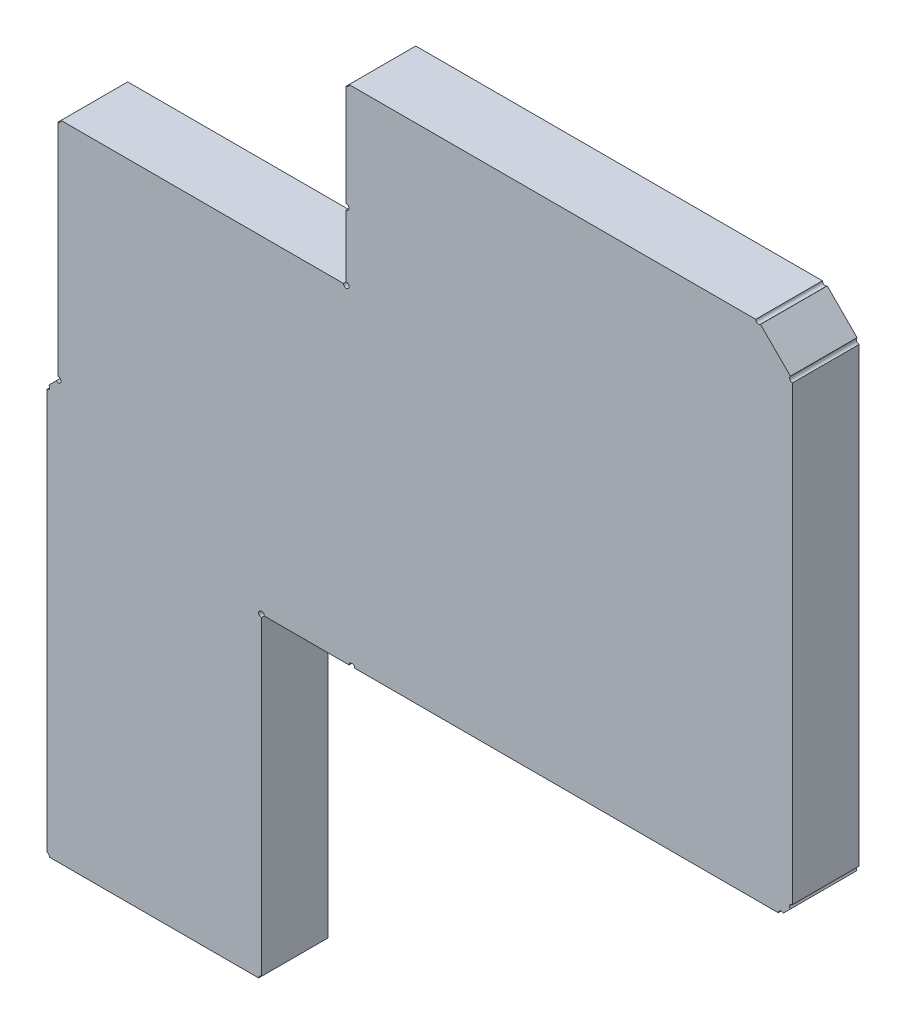
ISO-10303-21;
HEADER;
FILE_DESCRIPTION(('STEP AP214'),'2;1');
FILE_NAME('part.step','',(''),(''),'','','');
FILE_SCHEMA(('AUTOMOTIVE_DESIGN { 1 0 10303 214 1 1 1 1 }'));
ENDSEC;
DATA;
#1=APPLICATION_CONTEXT('core data for automotive mechanical design processes');
#2=APPLICATION_PROTOCOL_DEFINITION('international standard','automotive_design',2000,#1);
#3=PRODUCT_CONTEXT('',#1,'mechanical');
#4=PRODUCT('Part','Part','',(#3));
#5=PRODUCT_RELATED_PRODUCT_CATEGORY('part','',(#4));
#6=PRODUCT_DEFINITION_FORMATION('','',#4);
#7=PRODUCT_DEFINITION_CONTEXT('part definition',#1,'design');
#8=PRODUCT_DEFINITION('design','',#6,#7);
#9=PRODUCT_DEFINITION_SHAPE('','',#8);
#10=(LENGTH_UNIT() NAMED_UNIT(*) SI_UNIT(.MILLI.,.METRE.));
#11=(NAMED_UNIT(*) PLANE_ANGLE_UNIT() SI_UNIT($,.RADIAN.));
#12=(NAMED_UNIT(*) SI_UNIT($,.STERADIAN.) SOLID_ANGLE_UNIT());
#13=UNCERTAINTY_MEASURE_WITH_UNIT(LENGTH_MEASURE(1.E-05),#10,'distance_accuracy_value','');
#14=(GEOMETRIC_REPRESENTATION_CONTEXT(3) GLOBAL_UNCERTAINTY_ASSIGNED_CONTEXT((#13)) GLOBAL_UNIT_ASSIGNED_CONTEXT((#10,
#11,#12)) REPRESENTATION_CONTEXT('',''));
#15=CARTESIAN_POINT('',(0.,0.,0.));
#16=DIRECTION('',(0.,0.,1.));
#17=DIRECTION('',(1.,0.,0.));
#18=AXIS2_PLACEMENT_3D('',#15,#16,#17);
#19=CARTESIAN_POINT('',(91.186,90.424,1.5));
#20=DIRECTION('',(0.,0.,-1.));
#21=DIRECTION('',(-1.,0.,0.));
#22=AXIS2_PLACEMENT_3D('',#19,#20,#21);
#23=CYLINDRICAL_SURFACE('',#22,0.0634999999999941);
#24=CARTESIAN_POINT('',(91.186,90.424,0.));
#25=DIRECTION('',(0.,0.,1.));
#26=DIRECTION('',(1.,0.,0.));
#27=AXIS2_PLACEMENT_3D('',#24,#25,#26);
#28=CIRCLE('',#27,0.0634999999999941);
#29=CARTESIAN_POINT('',(91.186,90.3605,0.));
#30=VERTEX_POINT('',#29);
#31=CARTESIAN_POINT('',(91.2495,90.424,0.));
#32=VERTEX_POINT('',#31);
#33=EDGE_CURVE('E257',#30,#32,#28,.T.);
#34=ORIENTED_EDGE('',*,*,#33,.F.);
#35=DIRECTION('',(0.,0.,-1.));
#36=VECTOR('',#35,1.);
#37=CARTESIAN_POINT('',(91.186,90.3605,1.5));
#38=LINE('',#37,#36);
#39=CARTESIAN_POINT('',(91.186,90.3605,1.5));
#40=VERTEX_POINT('',#39);
#41=EDGE_CURVE('E11',#40,#30,#38,.T.);
#42=ORIENTED_EDGE('',*,*,#41,.F.);
#43=CARTESIAN_POINT('',(91.186,90.424,1.5));
#44=DIRECTION('',(0.,0.,1.));
#45=DIRECTION('',(1.,0.,0.));
#46=AXIS2_PLACEMENT_3D('',#43,#44,#45);
#47=CIRCLE('',#46,0.0634999999999941);
#48=CARTESIAN_POINT('',(91.2495,90.424,1.5));
#49=VERTEX_POINT('',#48);
#50=EDGE_CURVE('E365',#40,#49,#47,.T.);
#51=ORIENTED_EDGE('',*,*,#50,.T.);
#52=DIRECTION('',(0.,0.,-1.));
#53=VECTOR('',#52,1.);
#54=CARTESIAN_POINT('',(91.2495,90.424,1.5));
#55=LINE('',#54,#53);
#56=EDGE_CURVE('E56',#49,#32,#55,.T.);
#57=ORIENTED_EDGE('',*,*,#56,.T.);
#58=EDGE_LOOP('',(#34,#42,#51,#57));
#59=FACE_BOUND('',#58,.T.);
#60=ADVANCED_FACE('F39',(#59),#23,.F.);
#61=CARTESIAN_POINT('',(91.186,0.,1.5));
#62=DIRECTION('',(-1.,0.,0.));
#63=DIRECTION('',(0.,0.,1.));
#64=AXIS2_PLACEMENT_3D('',#61,#62,#63);
#65=PLANE('',#64);
#66=DIRECTION('',(0.,1.,0.));
#67=VECTOR('',#66,1.);
#68=CARTESIAN_POINT('',(91.186,0.,0.));
#69=LINE('',#68,#67);
#70=CARTESIAN_POINT('',(91.186,85.4075,0.));
#71=VERTEX_POINT('',#70);
#72=EDGE_CURVE('E260',#71,#30,#69,.T.);
#73=ORIENTED_EDGE('',*,*,#72,.F.);
#74=DIRECTION('',(0.,0.,-1.));
#75=VECTOR('',#74,1.);
#76=CARTESIAN_POINT('',(91.186,85.4075,1.5));
#77=LINE('',#76,#75);
#78=CARTESIAN_POINT('',(91.186,85.4075,1.5));
#79=VERTEX_POINT('',#78);
#80=EDGE_CURVE('E48',#79,#71,#77,.T.);
#81=ORIENTED_EDGE('',*,*,#80,.F.);
#82=DIRECTION('',(0.,1.,0.));
#83=VECTOR('',#82,1.);
#84=CARTESIAN_POINT('',(91.186,0.,1.5));
#85=LINE('',#84,#83);
#86=EDGE_CURVE('E460',#79,#40,#85,.T.);
#87=ORIENTED_EDGE('',*,*,#86,.T.);
#88=ORIENTED_EDGE('',*,*,#41,.T.);
#89=EDGE_LOOP('',(#73,#81,#87,#88));
#90=FACE_BOUND('',#89,.T.);
#91=ADVANCED_FACE('F448',(#90),#65,.T.);
#92=CARTESIAN_POINT('',(91.186,85.344,1.5));
#93=DIRECTION('',(0.,0.,-1.));
#94=DIRECTION('',(-1.,0.,0.));
#95=AXIS2_PLACEMENT_3D('',#92,#93,#94);
#96=CYLINDRICAL_SURFACE('',#95,0.0634999999999941);
#97=CARTESIAN_POINT('',(91.186,85.344,0.));
#98=DIRECTION('',(0.,0.,1.));
#99=DIRECTION('',(1.,0.,0.));
#100=AXIS2_PLACEMENT_3D('',#97,#98,#99);
#101=CIRCLE('',#100,0.0634999999999941);
#102=CARTESIAN_POINT('',(91.1410987193946,85.2990987193946,0.));
#103=VERTEX_POINT('',#102);
#104=EDGE_CURVE('E264',#103,#71,#101,.T.);
#105=ORIENTED_EDGE('',*,*,#104,.F.);
#106=DIRECTION('',(0.,0.,-1.));
#107=VECTOR('',#106,1.);
#108=CARTESIAN_POINT('',(91.1410987193946,85.2990987193946,1.5));
#109=LINE('',#108,#107);
#110=CARTESIAN_POINT('',(91.1410987193946,85.2990987193946,1.5));
#111=VERTEX_POINT('',#110);
#112=EDGE_CURVE('E435',#111,#103,#109,.T.);
#113=ORIENTED_EDGE('',*,*,#112,.F.);
#114=CARTESIAN_POINT('',(91.186,85.344,1.5));
#115=DIRECTION('',(0.,0.,1.));
#116=DIRECTION('',(1.,0.,0.));
#117=AXIS2_PLACEMENT_3D('',#114,#115,#116);
#118=CIRCLE('',#117,0.0634999999999941);
#119=EDGE_CURVE('E444',#111,#79,#118,.T.);
#120=ORIENTED_EDGE('',*,*,#119,.T.);
#121=ORIENTED_EDGE('',*,*,#80,.T.);
#122=EDGE_LOOP('',(#105,#113,#120,#121));
#123=FACE_BOUND('',#122,.T.);
#124=ADVANCED_FACE('F442',(#123),#96,.F.);
#125=CARTESIAN_POINT('',(2.921,-2.921,1.5));
#126=DIRECTION('',(-0.707106781186547,0.707106781186547,0.));
#127=DIRECTION('',(-0.707106781186548,-0.707106781186548,0.));
#128=AXIS2_PLACEMENT_3D('',#125,#126,#127);
#129=PLANE('',#128);
#130=DIRECTION('',(0.707106781186548,0.707106781186548,0.));
#131=VECTOR('',#130,1.);
#132=CARTESIAN_POINT('',(2.921,-2.921,0.));
#133=LINE('',#132,#131);
#134=CARTESIAN_POINT('',(90.9769012806053,85.1349012806053,0.));
#135=VERTEX_POINT('',#134);
#136=EDGE_CURVE('E268',#135,#103,#133,.T.);
#137=ORIENTED_EDGE('',*,*,#136,.F.);
#138=DIRECTION('',(0.,0.,-1.));
#139=VECTOR('',#138,1.);
#140=CARTESIAN_POINT('',(90.9769012806053,85.1349012806053,1.5));
#141=LINE('',#140,#139);
#142=CARTESIAN_POINT('',(90.9769012806053,85.1349012806053,1.5));
#143=VERTEX_POINT('',#142);
#144=EDGE_CURVE('E432',#143,#135,#141,.T.);
#145=ORIENTED_EDGE('',*,*,#144,.F.);
#146=DIRECTION('',(0.707106781186548,0.707106781186548,0.));
#147=VECTOR('',#146,1.);
#148=CARTESIAN_POINT('',(2.921,-2.921,1.5));
#149=LINE('',#148,#147);
#150=EDGE_CURVE('E457',#143,#111,#149,.T.);
#151=ORIENTED_EDGE('',*,*,#150,.T.);
#152=ORIENTED_EDGE('',*,*,#112,.T.);
#153=EDGE_LOOP('',(#137,#145,#151,#152));
#154=FACE_BOUND('',#153,.T.);
#155=ADVANCED_FACE('F454',(#154),#129,.T.);
#156=CARTESIAN_POINT('',(90.932,85.09,1.5));
#157=DIRECTION('',(0.,0.,-1.));
#158=DIRECTION('',(-1.,0.,0.));
#159=AXIS2_PLACEMENT_3D('',#156,#157,#158);
#160=CYLINDRICAL_SURFACE('',#159,0.0634999999999802);
#161=CARTESIAN_POINT('',(90.932,85.09,0.));
#162=DIRECTION('',(0.,0.,1.));
#163=DIRECTION('',(1.,0.,0.));
#164=AXIS2_PLACEMENT_3D('',#161,#162,#163);
#165=CIRCLE('',#164,0.0634999999999802);
#166=CARTESIAN_POINT('',(90.932,85.0265,0.));
#167=VERTEX_POINT('',#166);
#168=EDGE_CURVE('E272',#167,#135,#165,.T.);
#169=ORIENTED_EDGE('',*,*,#168,.F.);
#170=DIRECTION('',(0.,0.,-1.));
#171=VECTOR('',#170,1.);
#172=CARTESIAN_POINT('',(90.932,85.0265,1.5));
#173=LINE('',#172,#171);
#174=CARTESIAN_POINT('',(90.932,85.0265,1.5));
#175=VERTEX_POINT('',#174);
#176=EDGE_CURVE('E429',#175,#167,#173,.T.);
#177=ORIENTED_EDGE('',*,*,#176,.F.);
#178=CARTESIAN_POINT('',(90.932,85.09,1.5));
#179=DIRECTION('',(0.,0.,1.));
#180=DIRECTION('',(1.,0.,0.));
#181=AXIS2_PLACEMENT_3D('',#178,#179,#180);
#182=CIRCLE('',#181,0.0634999999999802);
#183=EDGE_CURVE('E465',#175,#143,#182,.T.);
#184=ORIENTED_EDGE('',*,*,#183,.T.);
#185=ORIENTED_EDGE('',*,*,#144,.T.);
#186=EDGE_LOOP('',(#169,#177,#184,#185));
#187=FACE_BOUND('',#186,.T.);
#188=ADVANCED_FACE('F567',(#187),#160,.F.);
#189=CARTESIAN_POINT('',(90.932,0.,1.5));
#190=DIRECTION('',(-1.,0.,0.));
#191=DIRECTION('',(0.,0.,1.));
#192=AXIS2_PLACEMENT_3D('',#189,#190,#191);
#193=PLANE('',#192);
#194=DIRECTION('',(0.,1.,0.));
#195=VECTOR('',#194,1.);
#196=CARTESIAN_POINT('',(90.932,0.,0.));
#197=LINE('',#196,#195);
#198=CARTESIAN_POINT('',(90.932,76.0095,0.));
#199=VERTEX_POINT('',#198);
#200=EDGE_CURVE('E276',#199,#167,#197,.T.);
#201=ORIENTED_EDGE('',*,*,#200,.F.);
#202=DIRECTION('',(0.,0.,-1.));
#203=VECTOR('',#202,1.);
#204=CARTESIAN_POINT('',(90.932,76.0095,1.5));
#205=LINE('',#204,#203);
#206=CARTESIAN_POINT('',(90.932,76.0095,1.5));
#207=VERTEX_POINT('',#206);
#208=EDGE_CURVE('E426',#207,#199,#205,.T.);
#209=ORIENTED_EDGE('',*,*,#208,.F.);
#210=DIRECTION('',(0.,1.,0.));
#211=VECTOR('',#210,1.);
#212=CARTESIAN_POINT('',(90.932,0.,1.5));
#213=LINE('',#212,#211);
#214=EDGE_CURVE('E472',#207,#175,#213,.T.);
#215=ORIENTED_EDGE('',*,*,#214,.T.);
#216=ORIENTED_EDGE('',*,*,#176,.T.);
#217=EDGE_LOOP('',(#201,#209,#215,#216));
#218=FACE_BOUND('',#217,.T.);
#219=ADVANCED_FACE('F570',(#218),#193,.T.);
#220=CARTESIAN_POINT('',(90.932,75.946,1.5));
#221=DIRECTION('',(0.,0.,-1.));
#222=DIRECTION('',(-1.,0.,0.));
#223=AXIS2_PLACEMENT_3D('',#220,#221,#222);
#224=CYLINDRICAL_SURFACE('',#223,0.0634999999999802);
#225=CARTESIAN_POINT('',(90.932,75.946,0.));
#226=DIRECTION('',(0.,0.,1.));
#227=DIRECTION('',(1.,0.,0.));
#228=AXIS2_PLACEMENT_3D('',#225,#226,#227);
#229=CIRCLE('',#228,0.0634999999999802);
#230=CARTESIAN_POINT('',(90.9955,75.946,0.));
#231=VERTEX_POINT('',#230);
#232=EDGE_CURVE('E280',#231,#199,#229,.T.);
#233=ORIENTED_EDGE('',*,*,#232,.F.);
#234=DIRECTION('',(0.,0.,-1.));
#235=VECTOR('',#234,1.);
#236=CARTESIAN_POINT('',(90.9955,75.946,1.5));
#237=LINE('',#236,#235);
#238=CARTESIAN_POINT('',(90.9955,75.946,1.5));
#239=VERTEX_POINT('',#238);
#240=EDGE_CURVE('E423',#239,#231,#237,.T.);
#241=ORIENTED_EDGE('',*,*,#240,.F.);
#242=CARTESIAN_POINT('',(90.932,75.946,1.5));
#243=DIRECTION('',(0.,0.,1.));
#244=DIRECTION('',(1.,0.,0.));
#245=AXIS2_PLACEMENT_3D('',#242,#243,#244);
#246=CIRCLE('',#245,0.0634999999999802);
#247=EDGE_CURVE('E476',#239,#207,#246,.T.);
#248=ORIENTED_EDGE('',*,*,#247,.T.);
#249=ORIENTED_EDGE('',*,*,#208,.T.);
#250=EDGE_LOOP('',(#233,#241,#248,#249));
#251=FACE_BOUND('',#250,.T.);
#252=ADVANCED_FACE('F574',(#251),#224,.F.);
#253=CARTESIAN_POINT('',(0.,75.946,1.5));
#254=DIRECTION('',(0.,1.,0.));
#255=DIRECTION('',(0.,0.,1.));
#256=AXIS2_PLACEMENT_3D('',#253,#254,#255);
#257=PLANE('',#256);
#258=DIRECTION('',(1.,0.,0.));
#259=VECTOR('',#258,1.);
#260=CARTESIAN_POINT('',(0.,75.946,0.));
#261=LINE('',#260,#259);
#262=CARTESIAN_POINT('',(95.6945,75.946,0.));
#263=VERTEX_POINT('',#262);
#264=EDGE_CURVE('E284',#231,#263,#261,.T.);
#265=ORIENTED_EDGE('',*,*,#264,.T.);
#266=DIRECTION('',(0.,0.,-1.));
#267=VECTOR('',#266,1.);
#268=CARTESIAN_POINT('',(95.6945,75.946,1.5));
#269=LINE('',#268,#267);
#270=CARTESIAN_POINT('',(95.6945,75.946,1.5));
#271=VERTEX_POINT('',#270);
#272=EDGE_CURVE('E420',#271,#263,#269,.T.);
#273=ORIENTED_EDGE('',*,*,#272,.F.);
#274=DIRECTION('',(1.,0.,0.));
#275=VECTOR('',#274,1.);
#276=CARTESIAN_POINT('',(0.,75.946,1.5));
#277=LINE('',#276,#275);
#278=EDGE_CURVE('E480',#239,#271,#277,.T.);
#279=ORIENTED_EDGE('',*,*,#278,.F.);
#280=ORIENTED_EDGE('',*,*,#240,.T.);
#281=EDGE_LOOP('',(#265,#273,#279,#280));
#282=FACE_BOUND('',#281,.T.);
#283=ADVANCED_FACE('F578',(#282),#257,.F.);
#284=CARTESIAN_POINT('',(95.758,75.946,1.5));
#285=DIRECTION('',(0.,0.,-1.));
#286=DIRECTION('',(-1.,0.,0.));
#287=AXIS2_PLACEMENT_3D('',#284,#285,#286);
#288=CYLINDRICAL_SURFACE('',#287,0.063500000000008);
#289=CARTESIAN_POINT('',(95.758,75.946,0.));
#290=DIRECTION('',(0.,0.,1.));
#291=DIRECTION('',(1.,0.,0.));
#292=AXIS2_PLACEMENT_3D('',#289,#290,#291);
#293=CIRCLE('',#292,0.063500000000008);
#294=CARTESIAN_POINT('',(95.758,76.0095,0.));
#295=VERTEX_POINT('',#294);
#296=EDGE_CURVE('E288',#295,#263,#293,.T.);
#297=ORIENTED_EDGE('',*,*,#296,.F.);
#298=DIRECTION('',(0.,0.,-1.));
#299=VECTOR('',#298,1.);
#300=CARTESIAN_POINT('',(95.758,76.0095,1.5));
#301=LINE('',#300,#299);
#302=CARTESIAN_POINT('',(95.758,76.0095,1.5));
#303=VERTEX_POINT('',#302);
#304=EDGE_CURVE('E417',#303,#295,#301,.T.);
#305=ORIENTED_EDGE('',*,*,#304,.F.);
#306=CARTESIAN_POINT('',(95.758,75.946,1.5));
#307=DIRECTION('',(0.,0.,1.));
#308=DIRECTION('',(1.,0.,0.));
#309=AXIS2_PLACEMENT_3D('',#306,#307,#308);
#310=CIRCLE('',#309,0.063500000000008);
#311=EDGE_CURVE('E483',#303,#271,#310,.T.);
#312=ORIENTED_EDGE('',*,*,#311,.T.);
#313=ORIENTED_EDGE('',*,*,#272,.T.);
#314=EDGE_LOOP('',(#297,#305,#312,#313));
#315=FACE_BOUND('',#314,.T.);
#316=ADVANCED_FACE('F582',(#315),#288,.F.);
#317=CARTESIAN_POINT('',(95.758,0.,1.5));
#318=DIRECTION('',(-1.,0.,0.));
#319=DIRECTION('',(0.,0.,1.));
#320=AXIS2_PLACEMENT_3D('',#317,#318,#319);
#321=PLANE('',#320);
#322=DIRECTION('',(0.,1.,0.));
#323=VECTOR('',#322,1.);
#324=CARTESIAN_POINT('',(95.758,0.,0.));
#325=LINE('',#324,#323);
#326=CARTESIAN_POINT('',(95.758,82.9945,0.));
#327=VERTEX_POINT('',#326);
#328=EDGE_CURVE('E292',#295,#327,#325,.T.);
#329=ORIENTED_EDGE('',*,*,#328,.T.);
#330=DIRECTION('',(0.,0.,-1.));
#331=VECTOR('',#330,1.);
#332=CARTESIAN_POINT('',(95.758,82.9945,1.5));
#333=LINE('',#332,#331);
#334=CARTESIAN_POINT('',(95.758,82.9945,1.5));
#335=VERTEX_POINT('',#334);
#336=EDGE_CURVE('E414',#335,#327,#333,.T.);
#337=ORIENTED_EDGE('',*,*,#336,.F.);
#338=DIRECTION('',(0.,1.,0.));
#339=VECTOR('',#338,1.);
#340=CARTESIAN_POINT('',(95.758,0.,1.5));
#341=LINE('',#340,#339);
#342=EDGE_CURVE('E487',#303,#335,#341,.T.);
#343=ORIENTED_EDGE('',*,*,#342,.F.);
#344=ORIENTED_EDGE('',*,*,#304,.T.);
#345=EDGE_LOOP('',(#329,#337,#343,#344));
#346=FACE_BOUND('',#345,.T.);
#347=ADVANCED_FACE('F586',(#346),#321,.F.);
#348=CARTESIAN_POINT('',(95.758,83.058,1.5));
#349=DIRECTION('',(0.,0.,-1.));
#350=DIRECTION('',(-1.,0.,0.));
#351=AXIS2_PLACEMENT_3D('',#348,#349,#350);
#352=CYLINDRICAL_SURFACE('',#351,0.063500000000008);
#353=CARTESIAN_POINT('',(95.758,83.058,0.));
#354=DIRECTION('',(0.,0.,1.));
#355=DIRECTION('',(1.,0.,0.));
#356=AXIS2_PLACEMENT_3D('',#353,#354,#355);
#357=CIRCLE('',#356,0.063500000000008);
#358=CARTESIAN_POINT('',(95.8215,83.058,0.));
#359=VERTEX_POINT('',#358);
#360=EDGE_CURVE('E296',#359,#327,#357,.T.);
#361=ORIENTED_EDGE('',*,*,#360,.F.);
#362=DIRECTION('',(0.,0.,-1.));
#363=VECTOR('',#362,1.);
#364=CARTESIAN_POINT('',(95.8215,83.058,1.5));
#365=LINE('',#364,#363);
#366=CARTESIAN_POINT('',(95.8215,83.058,1.5));
#367=VERTEX_POINT('',#366);
#368=EDGE_CURVE('E411',#367,#359,#365,.T.);
#369=ORIENTED_EDGE('',*,*,#368,.F.);
#370=CARTESIAN_POINT('',(95.758,83.058,1.5));
#371=DIRECTION('',(0.,0.,1.));
#372=DIRECTION('',(1.,0.,0.));
#373=AXIS2_PLACEMENT_3D('',#370,#371,#372);
#374=CIRCLE('',#373,0.063500000000008);
#375=EDGE_CURVE('E490',#367,#335,#374,.T.);
#376=ORIENTED_EDGE('',*,*,#375,.T.);
#377=ORIENTED_EDGE('',*,*,#336,.T.);
#378=EDGE_LOOP('',(#361,#369,#376,#377));
#379=FACE_BOUND('',#378,.T.);
#380=ADVANCED_FACE('F590',(#379),#352,.F.);
#381=CARTESIAN_POINT('',(0.,83.058,1.5));
#382=DIRECTION('',(0.,1.,0.));
#383=DIRECTION('',(0.,0.,1.));
#384=AXIS2_PLACEMENT_3D('',#381,#382,#383);
#385=PLANE('',#384);
#386=DIRECTION('',(1.,0.,0.));
#387=VECTOR('',#386,1.);
#388=CARTESIAN_POINT('',(0.,83.058,0.));
#389=LINE('',#388,#387);
#390=CARTESIAN_POINT('',(97.7265,83.058,0.));
#391=VERTEX_POINT('',#390);
#392=EDGE_CURVE('E300',#359,#391,#389,.T.);
#393=ORIENTED_EDGE('',*,*,#392,.T.);
#394=DIRECTION('',(0.,0.,-1.));
#395=VECTOR('',#394,1.);
#396=CARTESIAN_POINT('',(97.7265,83.058,1.5));
#397=LINE('',#396,#395);
#398=CARTESIAN_POINT('',(97.7265,83.058,1.5));
#399=VERTEX_POINT('',#398);
#400=EDGE_CURVE('E408',#399,#391,#397,.T.);
#401=ORIENTED_EDGE('',*,*,#400,.F.);
#402=DIRECTION('',(1.,0.,0.));
#403=VECTOR('',#402,1.);
#404=CARTESIAN_POINT('',(0.,83.058,1.5));
#405=LINE('',#404,#403);
#406=EDGE_CURVE('E494',#367,#399,#405,.T.);
#407=ORIENTED_EDGE('',*,*,#406,.F.);
#408=ORIENTED_EDGE('',*,*,#368,.T.);
#409=EDGE_LOOP('',(#393,#401,#407,#408));
#410=FACE_BOUND('',#409,.T.);
#411=ADVANCED_FACE('F594',(#410),#385,.F.);
#412=CARTESIAN_POINT('',(97.79,83.058,1.5));
#413=DIRECTION('',(0.,0.,-1.));
#414=DIRECTION('',(-1.,0.,0.));
#415=AXIS2_PLACEMENT_3D('',#412,#413,#414);
#416=CYLINDRICAL_SURFACE('',#415,0.0634999999999802);
#417=CARTESIAN_POINT('',(97.79,83.058,0.));
#418=DIRECTION('',(0.,0.,1.));
#419=DIRECTION('',(1.,0.,0.));
#420=AXIS2_PLACEMENT_3D('',#417,#418,#419);
#421=CIRCLE('',#420,0.0634999999999802);
#422=CARTESIAN_POINT('',(97.8535,83.058,0.));
#423=VERTEX_POINT('',#422);
#424=EDGE_CURVE('E304',#423,#391,#421,.T.);
#425=ORIENTED_EDGE('',*,*,#424,.F.);
#426=DIRECTION('',(0.,0.,-1.));
#427=VECTOR('',#426,1.);
#428=CARTESIAN_POINT('',(97.8535,83.058,1.5));
#429=LINE('',#428,#427);
#430=CARTESIAN_POINT('',(97.8535,83.058,1.5));
#431=VERTEX_POINT('',#430);
#432=EDGE_CURVE('E405',#431,#423,#429,.T.);
#433=ORIENTED_EDGE('',*,*,#432,.F.);
#434=CARTESIAN_POINT('',(97.79,83.058,1.5));
#435=DIRECTION('',(0.,0.,1.));
#436=DIRECTION('',(1.,0.,0.));
#437=AXIS2_PLACEMENT_3D('',#434,#435,#436);
#438=CIRCLE('',#437,0.0634999999999802);
#439=EDGE_CURVE('E497',#431,#399,#438,.T.);
#440=ORIENTED_EDGE('',*,*,#439,.T.);
#441=ORIENTED_EDGE('',*,*,#400,.T.);
#442=EDGE_LOOP('',(#425,#433,#440,#441));
#443=FACE_BOUND('',#442,.T.);
#444=ADVANCED_FACE('F598',(#443),#416,.F.);
#445=CARTESIAN_POINT('',(0.,83.058,1.5));
#446=DIRECTION('',(0.,1.,0.));
#447=DIRECTION('',(0.,0.,1.));
#448=AXIS2_PLACEMENT_3D('',#445,#446,#447);
#449=PLANE('',#448);
#450=DIRECTION('',(1.,0.,0.));
#451=VECTOR('',#450,1.);
#452=CARTESIAN_POINT('',(0.,83.058,0.));
#453=LINE('',#452,#451);
#454=CARTESIAN_POINT('',(107.3785,83.058,0.));
#455=VERTEX_POINT('',#454);
#456=EDGE_CURVE('E308',#423,#455,#453,.T.);
#457=ORIENTED_EDGE('',*,*,#456,.T.);
#458=DIRECTION('',(0.,0.,-1.));
#459=VECTOR('',#458,1.);
#460=CARTESIAN_POINT('',(107.3785,83.058,1.5));
#461=LINE('',#460,#459);
#462=CARTESIAN_POINT('',(107.3785,83.058,1.5));
#463=VERTEX_POINT('',#462);
#464=EDGE_CURVE('E402',#463,#455,#461,.T.);
#465=ORIENTED_EDGE('',*,*,#464,.F.);
#466=DIRECTION('',(1.,0.,0.));
#467=VECTOR('',#466,1.);
#468=CARTESIAN_POINT('',(0.,83.058,1.5));
#469=LINE('',#468,#467);
#470=EDGE_CURVE('E501',#431,#463,#469,.T.);
#471=ORIENTED_EDGE('',*,*,#470,.F.);
#472=ORIENTED_EDGE('',*,*,#432,.T.);
#473=EDGE_LOOP('',(#457,#465,#471,#472));
#474=FACE_BOUND('',#473,.T.);
#475=ADVANCED_FACE('F602',(#474),#449,.F.);
#476=CARTESIAN_POINT('',(107.442,83.058,1.5));
#477=DIRECTION('',(0.,0.,-1.));
#478=DIRECTION('',(-1.,0.,0.));
#479=AXIS2_PLACEMENT_3D('',#476,#477,#478);
#480=CYLINDRICAL_SURFACE('',#479,0.0634999999999941);
#481=CARTESIAN_POINT('',(107.442,83.058,0.));
#482=DIRECTION('',(0.,0.,1.));
#483=DIRECTION('',(1.,0.,0.));
#484=AXIS2_PLACEMENT_3D('',#481,#482,#483);
#485=CIRCLE('',#484,0.0634999999999941);
#486=CARTESIAN_POINT('',(107.486901280605,83.1029012806053,0.));
#487=VERTEX_POINT('',#486);
#488=EDGE_CURVE('E312',#487,#455,#485,.T.);
#489=ORIENTED_EDGE('',*,*,#488,.F.);
#490=DIRECTION('',(0.,0.,-1.));
#491=VECTOR('',#490,1.);
#492=CARTESIAN_POINT('',(107.486901280605,83.1029012806053,1.5));
#493=LINE('',#492,#491);
#494=CARTESIAN_POINT('',(107.486901280605,83.1029012806053,1.5));
#495=VERTEX_POINT('',#494);
#496=EDGE_CURVE('E399',#495,#487,#493,.T.);
#497=ORIENTED_EDGE('',*,*,#496,.F.);
#498=CARTESIAN_POINT('',(107.442,83.058,1.5));
#499=DIRECTION('',(0.,0.,1.));
#500=DIRECTION('',(1.,0.,0.));
#501=AXIS2_PLACEMENT_3D('',#498,#499,#500);
#502=CIRCLE('',#501,0.0634999999999941);
#503=EDGE_CURVE('E504',#495,#463,#502,.T.);
#504=ORIENTED_EDGE('',*,*,#503,.T.);
#505=ORIENTED_EDGE('',*,*,#464,.T.);
#506=EDGE_LOOP('',(#489,#497,#504,#505));
#507=FACE_BOUND('',#506,.T.);
#508=ADVANCED_FACE('F606',(#507),#480,.F.);
#509=CARTESIAN_POINT('',(12.192,-12.192,1.5));
#510=DIRECTION('',(-0.707106781186547,0.707106781186547,0.));
#511=DIRECTION('',(-0.707106781186548,-0.707106781186548,0.));
#512=AXIS2_PLACEMENT_3D('',#509,#510,#511);
#513=PLANE('',#512);
#514=DIRECTION('',(0.707106781186548,0.707106781186548,0.));
#515=VECTOR('',#514,1.);
#516=CARTESIAN_POINT('',(12.192,-12.192,0.));
#517=LINE('',#516,#515);
#518=CARTESIAN_POINT('',(107.651098719395,83.2670987193946,0.));
#519=VERTEX_POINT('',#518);
#520=EDGE_CURVE('E316',#487,#519,#517,.T.);
#521=ORIENTED_EDGE('',*,*,#520,.T.);
#522=DIRECTION('',(0.,0.,-1.));
#523=VECTOR('',#522,1.);
#524=CARTESIAN_POINT('',(107.651098719395,83.2670987193946,1.5));
#525=LINE('',#524,#523);
#526=CARTESIAN_POINT('',(107.651098719395,83.2670987193946,1.5));
#527=VERTEX_POINT('',#526);
#528=EDGE_CURVE('E396',#527,#519,#525,.T.);
#529=ORIENTED_EDGE('',*,*,#528,.F.);
#530=DIRECTION('',(0.707106781186548,0.707106781186548,0.));
#531=VECTOR('',#530,1.);
#532=CARTESIAN_POINT('',(12.192,-12.192,1.5));
#533=LINE('',#532,#531);
#534=EDGE_CURVE('E508',#495,#527,#533,.T.);
#535=ORIENTED_EDGE('',*,*,#534,.F.);
#536=ORIENTED_EDGE('',*,*,#496,.T.);
#537=EDGE_LOOP('',(#521,#529,#535,#536));
#538=FACE_BOUND('',#537,.T.);
#539=ADVANCED_FACE('F610',(#538),#513,.F.);
#540=CARTESIAN_POINT('',(107.696,83.312,1.5));
#541=DIRECTION('',(0.,0.,-1.));
#542=DIRECTION('',(-1.,0.,0.));
#543=AXIS2_PLACEMENT_3D('',#540,#541,#542);
#544=CYLINDRICAL_SURFACE('',#543,0.063500000000008);
#545=CARTESIAN_POINT('',(107.696,83.312,0.));
#546=DIRECTION('',(0.,0.,1.));
#547=DIRECTION('',(1.,0.,0.));
#548=AXIS2_PLACEMENT_3D('',#545,#546,#547);
#549=CIRCLE('',#548,0.063500000000008);
#550=CARTESIAN_POINT('',(107.696,83.3755,0.));
#551=VERTEX_POINT('',#550);
#552=EDGE_CURVE('E320',#551,#519,#549,.T.);
#553=ORIENTED_EDGE('',*,*,#552,.F.);
#554=DIRECTION('',(0.,0.,-1.));
#555=VECTOR('',#554,1.);
#556=CARTESIAN_POINT('',(107.696,83.3755,1.5));
#557=LINE('',#556,#555);
#558=CARTESIAN_POINT('',(107.696,83.3755,1.5));
#559=VERTEX_POINT('',#558);
#560=EDGE_CURVE('E393',#559,#551,#557,.T.);
#561=ORIENTED_EDGE('',*,*,#560,.F.);
#562=CARTESIAN_POINT('',(107.696,83.312,1.5));
#563=DIRECTION('',(0.,0.,1.));
#564=DIRECTION('',(1.,0.,0.));
#565=AXIS2_PLACEMENT_3D('',#562,#563,#564);
#566=CIRCLE('',#565,0.063500000000008);
#567=EDGE_CURVE('E511',#559,#527,#566,.T.);
#568=ORIENTED_EDGE('',*,*,#567,.T.);
#569=ORIENTED_EDGE('',*,*,#528,.T.);
#570=EDGE_LOOP('',(#553,#561,#568,#569));
#571=FACE_BOUND('',#570,.T.);
#572=ADVANCED_FACE('F614',(#571),#544,.F.);
#573=CARTESIAN_POINT('',(107.696,0.,1.5));
#574=DIRECTION('',(-1.,0.,0.));
#575=DIRECTION('',(0.,0.,1.));
#576=AXIS2_PLACEMENT_3D('',#573,#574,#575);
#577=PLANE('',#576);
#578=DIRECTION('',(0.,1.,0.));
#579=VECTOR('',#578,1.);
#580=CARTESIAN_POINT('',(107.696,0.,0.));
#581=LINE('',#580,#579);
#582=CARTESIAN_POINT('',(107.696,93.5355,0.));
#583=VERTEX_POINT('',#582);
#584=EDGE_CURVE('E324',#551,#583,#581,.T.);
#585=ORIENTED_EDGE('',*,*,#584,.T.);
#586=DIRECTION('',(0.,0.,-1.));
#587=VECTOR('',#586,1.);
#588=CARTESIAN_POINT('',(107.696,93.5355,1.5));
#589=LINE('',#588,#587);
#590=CARTESIAN_POINT('',(107.696,93.5355,1.5));
#591=VERTEX_POINT('',#590);
#592=EDGE_CURVE('E390',#591,#583,#589,.T.);
#593=ORIENTED_EDGE('',*,*,#592,.F.);
#594=DIRECTION('',(0.,1.,0.));
#595=VECTOR('',#594,1.);
#596=CARTESIAN_POINT('',(107.696,0.,1.5));
#597=LINE('',#596,#595);
#598=EDGE_CURVE('E515',#559,#591,#597,.T.);
#599=ORIENTED_EDGE('',*,*,#598,.F.);
#600=ORIENTED_EDGE('',*,*,#560,.T.);
#601=EDGE_LOOP('',(#585,#593,#599,#600));
#602=FACE_BOUND('',#601,.T.);
#603=ADVANCED_FACE('F618',(#602),#577,.F.);
#604=CARTESIAN_POINT('',(107.696,93.599,1.5));
#605=DIRECTION('',(0.,0.,-1.));
#606=DIRECTION('',(-1.,0.,0.));
#607=AXIS2_PLACEMENT_3D('',#604,#605,#606);
#608=CYLINDRICAL_SURFACE('',#607,0.063500000000008);
#609=CARTESIAN_POINT('',(107.696,93.599,0.));
#610=DIRECTION('',(0.,0.,1.));
#611=DIRECTION('',(1.,0.,0.));
#612=AXIS2_PLACEMENT_3D('',#609,#610,#611);
#613=CIRCLE('',#612,0.063500000000008);
#614=CARTESIAN_POINT('',(107.651098719395,93.6439012806053,0.));
#615=VERTEX_POINT('',#614);
#616=EDGE_CURVE('E328',#615,#583,#613,.T.);
#617=ORIENTED_EDGE('',*,*,#616,.F.);
#618=DIRECTION('',(0.,0.,-1.));
#619=VECTOR('',#618,1.);
#620=CARTESIAN_POINT('',(107.651098719395,93.6439012806053,1.5));
#621=LINE('',#620,#619);
#622=CARTESIAN_POINT('',(107.651098719395,93.6439012806053,1.5));
#623=VERTEX_POINT('',#622);
#624=EDGE_CURVE('E387',#623,#615,#621,.T.);
#625=ORIENTED_EDGE('',*,*,#624,.F.);
#626=CARTESIAN_POINT('',(107.696,93.599,1.5));
#627=DIRECTION('',(0.,0.,1.));
#628=DIRECTION('',(1.,0.,0.));
#629=AXIS2_PLACEMENT_3D('',#626,#627,#628);
#630=CIRCLE('',#629,0.063500000000008);
#631=EDGE_CURVE('E518',#623,#591,#630,.T.);
#632=ORIENTED_EDGE('',*,*,#631,.T.);
#633=ORIENTED_EDGE('',*,*,#592,.T.);
#634=EDGE_LOOP('',(#617,#625,#632,#633));
#635=FACE_BOUND('',#634,.T.);
#636=ADVANCED_FACE('F622',(#635),#608,.F.);
#637=CARTESIAN_POINT('',(100.6475,100.6475,1.5));
#638=DIRECTION('',(0.707106781186547,0.707106781186547,0.));
#639=DIRECTION('',(-0.707106781186548,0.707106781186548,0.));
#640=AXIS2_PLACEMENT_3D('',#637,#638,#639);
#641=PLANE('',#640);
#642=DIRECTION('',(0.707106781186548,-0.707106781186548,0.));
#643=VECTOR('',#642,1.);
#644=CARTESIAN_POINT('',(100.6475,100.6475,0.));
#645=LINE('',#644,#643);
#646=CARTESIAN_POINT('',(106.978901280605,94.3160987193946,0.));
#647=VERTEX_POINT('',#646);
#648=EDGE_CURVE('E332',#647,#615,#645,.T.);
#649=ORIENTED_EDGE('',*,*,#648,.F.);
#650=DIRECTION('',(0.,0.,-1.));
#651=VECTOR('',#650,1.);
#652=CARTESIAN_POINT('',(106.978901280605,94.3160987193946,1.5));
#653=LINE('',#652,#651);
#654=CARTESIAN_POINT('',(106.978901280605,94.3160987193946,1.5));
#655=VERTEX_POINT('',#654);
#656=EDGE_CURVE('E384',#655,#647,#653,.T.);
#657=ORIENTED_EDGE('',*,*,#656,.F.);
#658=DIRECTION('',(0.707106781186548,-0.707106781186548,0.));
#659=VECTOR('',#658,1.);
#660=CARTESIAN_POINT('',(100.6475,100.6475,1.5));
#661=LINE('',#660,#659);
#662=EDGE_CURVE('E522',#655,#623,#661,.T.);
#663=ORIENTED_EDGE('',*,*,#662,.T.);
#664=ORIENTED_EDGE('',*,*,#624,.T.);
#665=EDGE_LOOP('',(#649,#657,#663,#664));
#666=FACE_BOUND('',#665,.T.);
#667=ADVANCED_FACE('F626',(#666),#641,.T.);
#668=CARTESIAN_POINT('',(106.934,94.361,1.5));
#669=DIRECTION('',(0.,0.,-1.));
#670=DIRECTION('',(-1.,0.,0.));
#671=AXIS2_PLACEMENT_3D('',#668,#669,#670);
#672=CYLINDRICAL_SURFACE('',#671,0.0634999999999941);
#673=CARTESIAN_POINT('',(106.934,94.361,0.));
#674=DIRECTION('',(0.,0.,1.));
#675=DIRECTION('',(1.,0.,0.));
#676=AXIS2_PLACEMENT_3D('',#673,#674,#675);
#677=CIRCLE('',#676,0.0634999999999941);
#678=CARTESIAN_POINT('',(106.8705,94.361,0.));
#679=VERTEX_POINT('',#678);
#680=EDGE_CURVE('E336',#679,#647,#677,.T.);
#681=ORIENTED_EDGE('',*,*,#680,.F.);
#682=DIRECTION('',(0.,0.,-1.));
#683=VECTOR('',#682,1.);
#684=CARTESIAN_POINT('',(106.8705,94.361,1.5));
#685=LINE('',#684,#683);
#686=CARTESIAN_POINT('',(106.8705,94.361,1.5));
#687=VERTEX_POINT('',#686);
#688=EDGE_CURVE('E381',#687,#679,#685,.T.);
#689=ORIENTED_EDGE('',*,*,#688,.F.);
#690=CARTESIAN_POINT('',(106.934,94.361,1.5));
#691=DIRECTION('',(0.,0.,1.));
#692=DIRECTION('',(1.,0.,0.));
#693=AXIS2_PLACEMENT_3D('',#690,#691,#692);
#694=CIRCLE('',#693,0.0634999999999941);
#695=EDGE_CURVE('E526',#687,#655,#694,.T.);
#696=ORIENTED_EDGE('',*,*,#695,.T.);
#697=ORIENTED_EDGE('',*,*,#656,.T.);
#698=EDGE_LOOP('',(#681,#689,#696,#697));
#699=FACE_BOUND('',#698,.T.);
#700=ADVANCED_FACE('F630',(#699),#672,.F.);
#701=CARTESIAN_POINT('',(0.,94.361,1.5));
#702=DIRECTION('',(0.,1.,0.));
#703=DIRECTION('',(0.,0.,1.));
#704=AXIS2_PLACEMENT_3D('',#701,#702,#703);
#705=PLANE('',#704);
#706=DIRECTION('',(1.,0.,0.));
#707=VECTOR('',#706,1.);
#708=CARTESIAN_POINT('',(0.,94.361,0.));
#709=LINE('',#708,#707);
#710=CARTESIAN_POINT('',(97.7265,94.361,0.));
#711=VERTEX_POINT('',#710);
#712=EDGE_CURVE('E340',#711,#679,#709,.T.);
#713=ORIENTED_EDGE('',*,*,#712,.F.);
#714=DIRECTION('',(0.,0.,-1.));
#715=VECTOR('',#714,1.);
#716=CARTESIAN_POINT('',(97.7265,94.361,1.5));
#717=LINE('',#716,#715);
#718=CARTESIAN_POINT('',(97.7265,94.361,1.5));
#719=VERTEX_POINT('',#718);
#720=EDGE_CURVE('E378',#719,#711,#717,.T.);
#721=ORIENTED_EDGE('',*,*,#720,.F.);
#722=DIRECTION('',(1.,0.,0.));
#723=VECTOR('',#722,1.);
#724=CARTESIAN_POINT('',(0.,94.361,1.5));
#725=LINE('',#724,#723);
#726=EDGE_CURVE('E530',#719,#687,#725,.T.);
#727=ORIENTED_EDGE('',*,*,#726,.T.);
#728=ORIENTED_EDGE('',*,*,#688,.T.);
#729=EDGE_LOOP('',(#713,#721,#727,#728));
#730=FACE_BOUND('',#729,.T.);
#731=ADVANCED_FACE('F634',(#730),#705,.T.);
#732=CARTESIAN_POINT('',(97.663,94.361,1.5));
#733=DIRECTION('',(0.,0.,-1.));
#734=DIRECTION('',(-1.,0.,0.));
#735=AXIS2_PLACEMENT_3D('',#732,#733,#734);
#736=CYLINDRICAL_SURFACE('',#735,0.063500000000008);
#737=CARTESIAN_POINT('',(97.663,94.361,0.));
#738=DIRECTION('',(0.,0.,1.));
#739=DIRECTION('',(1.,0.,0.));
#740=AXIS2_PLACEMENT_3D('',#737,#738,#739);
#741=CIRCLE('',#740,0.063500000000008);
#742=CARTESIAN_POINT('',(97.663,94.2975,0.));
#743=VERTEX_POINT('',#742);
#744=EDGE_CURVE('E344',#743,#711,#741,.T.);
#745=ORIENTED_EDGE('',*,*,#744,.F.);
#746=DIRECTION('',(0.,0.,-1.));
#747=VECTOR('',#746,1.);
#748=CARTESIAN_POINT('',(97.663,94.2975,1.5));
#749=LINE('',#748,#747);
#750=CARTESIAN_POINT('',(97.663,94.2975,1.5));
#751=VERTEX_POINT('',#750);
#752=EDGE_CURVE('E375',#751,#743,#749,.T.);
#753=ORIENTED_EDGE('',*,*,#752,.F.);
#754=CARTESIAN_POINT('',(97.663,94.361,1.5));
#755=DIRECTION('',(0.,0.,1.));
#756=DIRECTION('',(1.,0.,0.));
#757=AXIS2_PLACEMENT_3D('',#754,#755,#756);
#758=CIRCLE('',#757,0.063500000000008);
#759=EDGE_CURVE('E534',#751,#719,#758,.T.);
#760=ORIENTED_EDGE('',*,*,#759,.T.);
#761=ORIENTED_EDGE('',*,*,#720,.T.);
#762=EDGE_LOOP('',(#745,#753,#760,#761));
#763=FACE_BOUND('',#762,.T.);
#764=ADVANCED_FACE('F638',(#763),#736,.F.);
#765=CARTESIAN_POINT('',(97.663,0.,1.5));
#766=DIRECTION('',(-1.,0.,0.));
#767=DIRECTION('',(0.,0.,1.));
#768=AXIS2_PLACEMENT_3D('',#765,#766,#767);
#769=PLANE('',#768);
#770=DIRECTION('',(0.,1.,0.));
#771=VECTOR('',#770,1.);
#772=CARTESIAN_POINT('',(97.663,0.,0.));
#773=LINE('',#772,#771);
#774=CARTESIAN_POINT('',(97.663,92.0115,0.));
#775=VERTEX_POINT('',#774);
#776=EDGE_CURVE('E348',#775,#743,#773,.T.);
#777=ORIENTED_EDGE('',*,*,#776,.F.);
#778=DIRECTION('',(0.,0.,-1.));
#779=VECTOR('',#778,1.);
#780=CARTESIAN_POINT('',(97.663,92.0115,1.5));
#781=LINE('',#780,#779);
#782=CARTESIAN_POINT('',(97.663,92.0115,1.5));
#783=VERTEX_POINT('',#782);
#784=EDGE_CURVE('E372',#783,#775,#781,.T.);
#785=ORIENTED_EDGE('',*,*,#784,.F.);
#786=DIRECTION('',(0.,1.,0.));
#787=VECTOR('',#786,1.);
#788=CARTESIAN_POINT('',(97.663,0.,1.5));
#789=LINE('',#788,#787);
#790=EDGE_CURVE('E538',#783,#751,#789,.T.);
#791=ORIENTED_EDGE('',*,*,#790,.T.);
#792=ORIENTED_EDGE('',*,*,#752,.T.);
#793=EDGE_LOOP('',(#777,#785,#791,#792));
#794=FACE_BOUND('',#793,.T.);
#795=ADVANCED_FACE('F642',(#794),#769,.T.);
#796=CARTESIAN_POINT('',(97.663,91.948,1.5));
#797=DIRECTION('',(0.,0.,-1.));
#798=DIRECTION('',(-1.,0.,0.));
#799=AXIS2_PLACEMENT_3D('',#796,#797,#798);
#800=CYLINDRICAL_SURFACE('',#799,0.063500000000008);
#801=CARTESIAN_POINT('',(97.663,91.948,0.));
#802=DIRECTION('',(0.,0.,1.));
#803=DIRECTION('',(1.,0.,0.));
#804=AXIS2_PLACEMENT_3D('',#801,#802,#803);
#805=CIRCLE('',#804,0.063500000000008);
#806=CARTESIAN_POINT('',(97.663,91.8845,0.));
#807=VERTEX_POINT('',#806);
#808=EDGE_CURVE('E352',#807,#775,#805,.T.);
#809=ORIENTED_EDGE('',*,*,#808,.F.);
#810=DIRECTION('',(0.,0.,-1.));
#811=VECTOR('',#810,1.);
#812=CARTESIAN_POINT('',(97.663,91.8845,1.5));
#813=LINE('',#812,#811);
#814=CARTESIAN_POINT('',(97.663,91.8845,1.5));
#815=VERTEX_POINT('',#814);
#816=EDGE_CURVE('E236',#815,#807,#813,.T.);
#817=ORIENTED_EDGE('',*,*,#816,.F.);
#818=CARTESIAN_POINT('',(97.663,91.948,1.5));
#819=DIRECTION('',(0.,0.,1.));
#820=DIRECTION('',(1.,0.,0.));
#821=AXIS2_PLACEMENT_3D('',#818,#819,#820);
#822=CIRCLE('',#821,0.063500000000008);
#823=EDGE_CURVE('E246',#815,#783,#822,.T.);
#824=ORIENTED_EDGE('',*,*,#823,.T.);
#825=ORIENTED_EDGE('',*,*,#784,.T.);
#826=EDGE_LOOP('',(#809,#817,#824,#825));
#827=FACE_BOUND('',#826,.T.);
#828=ADVANCED_FACE('F544',(#827),#800,.F.);
#829=CARTESIAN_POINT('',(97.663,0.,1.5));
#830=DIRECTION('',(-1.,0.,0.));
#831=DIRECTION('',(0.,0.,1.));
#832=AXIS2_PLACEMENT_3D('',#829,#830,#831);
#833=PLANE('',#832);
#834=DIRECTION('',(0.,1.,0.));
#835=VECTOR('',#834,1.);
#836=CARTESIAN_POINT('',(97.663,0.,0.));
#837=LINE('',#836,#835);
#838=CARTESIAN_POINT('',(97.663,90.4875,0.));
#839=VERTEX_POINT('',#838);
#840=EDGE_CURVE('E231',#839,#807,#837,.T.);
#841=ORIENTED_EDGE('',*,*,#840,.F.);
#842=DIRECTION('',(0.,0.,-1.));
#843=VECTOR('',#842,1.);
#844=CARTESIAN_POINT('',(97.663,90.4875,1.5));
#845=LINE('',#844,#843);
#846=CARTESIAN_POINT('',(97.663,90.4875,1.5));
#847=VERTEX_POINT('',#846);
#848=EDGE_CURVE('E226',#847,#839,#845,.T.);
#849=ORIENTED_EDGE('',*,*,#848,.F.);
#850=DIRECTION('',(0.,1.,0.));
#851=VECTOR('',#850,1.);
#852=CARTESIAN_POINT('',(97.663,0.,1.5));
#853=LINE('',#852,#851);
#854=EDGE_CURVE('E229',#847,#815,#853,.T.);
#855=ORIENTED_EDGE('',*,*,#854,.T.);
#856=ORIENTED_EDGE('',*,*,#816,.T.);
#857=EDGE_LOOP('',(#841,#849,#855,#856));
#858=FACE_BOUND('',#857,.T.);
#859=ADVANCED_FACE('F228',(#858),#833,.T.);
#860=CARTESIAN_POINT('',(97.663,90.424,1.5));
#861=DIRECTION('',(0.,0.,-1.));
#862=DIRECTION('',(-1.,0.,0.));
#863=AXIS2_PLACEMENT_3D('',#860,#861,#862);
#864=CYLINDRICAL_SURFACE('',#863,0.063500000000008);
#865=CARTESIAN_POINT('',(97.663,90.424,0.));
#866=DIRECTION('',(0.,0.,1.));
#867=DIRECTION('',(1.,0.,0.));
#868=AXIS2_PLACEMENT_3D('',#865,#866,#867);
#869=CIRCLE('',#868,0.063500000000008);
#870=CARTESIAN_POINT('',(97.5995,90.424,0.));
#871=VERTEX_POINT('',#870);
#872=EDGE_CURVE('E358',#871,#839,#869,.T.);
#873=ORIENTED_EDGE('',*,*,#872,.F.);
#874=DIRECTION('',(0.,0.,-1.));
#875=VECTOR('',#874,1.);
#876=CARTESIAN_POINT('',(97.5995,90.424,1.5));
#877=LINE('',#876,#875);
#878=CARTESIAN_POINT('',(97.5995,90.424,1.5));
#879=VERTEX_POINT('',#878);
#880=EDGE_CURVE('E141',#879,#871,#877,.T.);
#881=ORIENTED_EDGE('',*,*,#880,.F.);
#882=CARTESIAN_POINT('',(97.663,90.424,1.5));
#883=DIRECTION('',(0.,0.,1.));
#884=DIRECTION('',(1.,0.,0.));
#885=AXIS2_PLACEMENT_3D('',#882,#883,#884);
#886=CIRCLE('',#885,0.063500000000008);
#887=EDGE_CURVE('E243',#879,#847,#886,.T.);
#888=ORIENTED_EDGE('',*,*,#887,.T.);
#889=ORIENTED_EDGE('',*,*,#848,.T.);
#890=EDGE_LOOP('',(#873,#881,#888,#889));
#891=FACE_BOUND('',#890,.T.);
#892=ADVANCED_FACE('F249',(#891),#864,.F.);
#893=CARTESIAN_POINT('',(0.,90.424,1.5));
#894=DIRECTION('',(0.,1.,0.));
#895=DIRECTION('',(0.,0.,1.));
#896=AXIS2_PLACEMENT_3D('',#893,#894,#895);
#897=PLANE('',#896);
#898=DIRECTION('',(1.,0.,0.));
#899=VECTOR('',#898,1.);
#900=CARTESIAN_POINT('',(0.,90.424,0.));
#901=LINE('',#900,#899);
#902=EDGE_CURVE('E361',#32,#871,#901,.T.);
#903=ORIENTED_EDGE('',*,*,#902,.F.);
#904=ORIENTED_EDGE('',*,*,#56,.F.);
#905=DIRECTION('',(1.,0.,0.));
#906=VECTOR('',#905,1.);
#907=CARTESIAN_POINT('',(0.,90.424,1.5));
#908=LINE('',#907,#906);
#909=EDGE_CURVE('E251',#49,#879,#908,.T.);
#910=ORIENTED_EDGE('',*,*,#909,.T.);
#911=ORIENTED_EDGE('',*,*,#880,.T.);
#912=EDGE_LOOP('',(#903,#904,#910,#911));
#913=FACE_BOUND('',#912,.T.);
#914=ADVANCED_FACE('F546',(#913),#897,.T.);
#915=CARTESIAN_POINT('',(0.,0.,1.5));
#916=DIRECTION('',(0.,0.,1.));
#917=DIRECTION('',(1.,0.,0.));
#918=AXIS2_PLACEMENT_3D('',#915,#916,#917);
#919=PLANE('',#918);
#920=ORIENTED_EDGE('',*,*,#50,.F.);
#921=ORIENTED_EDGE('',*,*,#86,.F.);
#922=ORIENTED_EDGE('',*,*,#119,.F.);
#923=ORIENTED_EDGE('',*,*,#150,.F.);
#924=ORIENTED_EDGE('',*,*,#183,.F.);
#925=ORIENTED_EDGE('',*,*,#214,.F.);
#926=ORIENTED_EDGE('',*,*,#247,.F.);
#927=ORIENTED_EDGE('',*,*,#278,.T.);
#928=ORIENTED_EDGE('',*,*,#311,.F.);
#929=ORIENTED_EDGE('',*,*,#342,.T.);
#930=ORIENTED_EDGE('',*,*,#375,.F.);
#931=ORIENTED_EDGE('',*,*,#406,.T.);
#932=ORIENTED_EDGE('',*,*,#439,.F.);
#933=ORIENTED_EDGE('',*,*,#470,.T.);
#934=ORIENTED_EDGE('',*,*,#503,.F.);
#935=ORIENTED_EDGE('',*,*,#534,.T.);
#936=ORIENTED_EDGE('',*,*,#567,.F.);
#937=ORIENTED_EDGE('',*,*,#598,.T.);
#938=ORIENTED_EDGE('',*,*,#631,.F.);
#939=ORIENTED_EDGE('',*,*,#662,.F.);
#940=ORIENTED_EDGE('',*,*,#695,.F.);
#941=ORIENTED_EDGE('',*,*,#726,.F.);
#942=ORIENTED_EDGE('',*,*,#759,.F.);
#943=ORIENTED_EDGE('',*,*,#790,.F.);
#944=ORIENTED_EDGE('',*,*,#823,.F.);
#945=ORIENTED_EDGE('',*,*,#854,.F.);
#946=ORIENTED_EDGE('',*,*,#887,.F.);
#947=ORIENTED_EDGE('',*,*,#909,.F.);
#948=EDGE_LOOP('',(#920,#921,#922,#923,#924,#925,#926,#927,#928,#929,#930,#931,#932,#933,#934,
#935,#936,#937,#938,#939,#940,#941,#942,#943,#944,#945,#946,#947));
#949=FACE_BOUND('',#948,.T.);
#950=ADVANCED_FACE('F241',(#949),#919,.T.);
#951=CARTESIAN_POINT('',(0.,0.,0.));
#952=DIRECTION('',(0.,0.,1.));
#953=DIRECTION('',(1.,0.,0.));
#954=AXIS2_PLACEMENT_3D('',#951,#952,#953);
#955=PLANE('',#954);
#956=ORIENTED_EDGE('',*,*,#33,.T.);
#957=ORIENTED_EDGE('',*,*,#902,.T.);
#958=ORIENTED_EDGE('',*,*,#872,.T.);
#959=ORIENTED_EDGE('',*,*,#840,.T.);
#960=ORIENTED_EDGE('',*,*,#808,.T.);
#961=ORIENTED_EDGE('',*,*,#776,.T.);
#962=ORIENTED_EDGE('',*,*,#744,.T.);
#963=ORIENTED_EDGE('',*,*,#712,.T.);
#964=ORIENTED_EDGE('',*,*,#680,.T.);
#965=ORIENTED_EDGE('',*,*,#648,.T.);
#966=ORIENTED_EDGE('',*,*,#616,.T.);
#967=ORIENTED_EDGE('',*,*,#584,.F.);
#968=ORIENTED_EDGE('',*,*,#552,.T.);
#969=ORIENTED_EDGE('',*,*,#520,.F.);
#970=ORIENTED_EDGE('',*,*,#488,.T.);
#971=ORIENTED_EDGE('',*,*,#456,.F.);
#972=ORIENTED_EDGE('',*,*,#424,.T.);
#973=ORIENTED_EDGE('',*,*,#392,.F.);
#974=ORIENTED_EDGE('',*,*,#360,.T.);
#975=ORIENTED_EDGE('',*,*,#328,.F.);
#976=ORIENTED_EDGE('',*,*,#296,.T.);
#977=ORIENTED_EDGE('',*,*,#264,.F.);
#978=ORIENTED_EDGE('',*,*,#232,.T.);
#979=ORIENTED_EDGE('',*,*,#200,.T.);
#980=ORIENTED_EDGE('',*,*,#168,.T.);
#981=ORIENTED_EDGE('',*,*,#136,.T.);
#982=ORIENTED_EDGE('',*,*,#104,.T.);
#983=ORIENTED_EDGE('',*,*,#72,.T.);
#984=EDGE_LOOP('',(#956,#957,#958,#959,#960,#961,#962,#963,#964,#965,#966,#967,#968,#969,#970,
#971,#972,#973,#974,#975,#976,#977,#978,#979,#980,#981,#982,#983));
#985=FACE_BOUND('',#984,.T.);
#986=ADVANCED_FACE('F450',(#985),#955,.F.);
#987=CLOSED_SHELL('',(#60,#91,#124,#155,#188,#219,#252,#283,#316,#347,#380,#411,#444,#475,#508,
#539,#572,#603,#636,#667,#700,#731,#764,#795,#828,#859,#892,#914,#950,#986));
#988=MANIFOLD_SOLID_BREP('B2',#987);
#989=ADVANCED_BREP_SHAPE_REPRESENTATION('',(#18,#988),#14);
#990=SHAPE_DEFINITION_REPRESENTATION(#9,#989);
ENDSEC;
END-ISO-10303-21;
